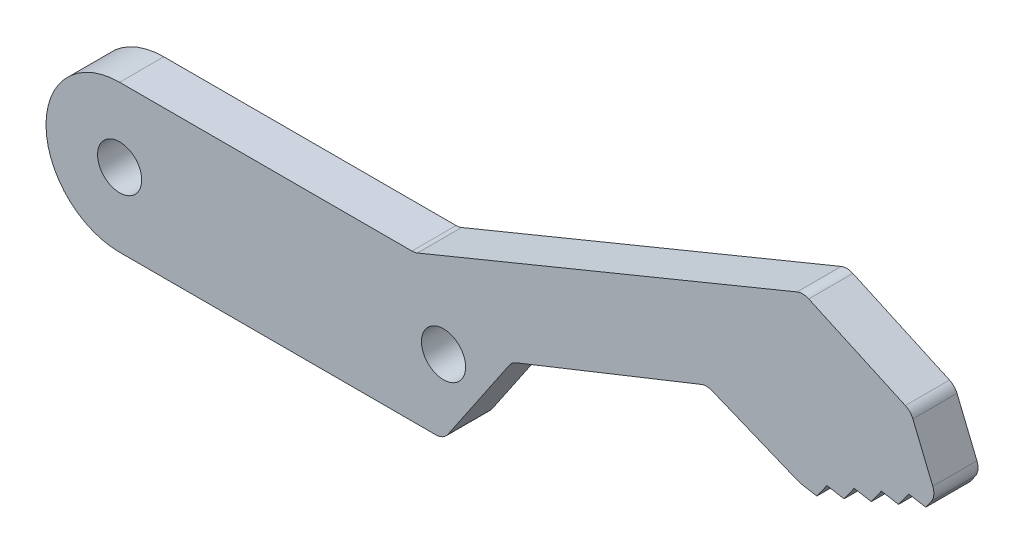
ISO-10303-21;
HEADER;
FILE_DESCRIPTION(('STEP AP214'),'2;1');
FILE_NAME('part.step','',(''),(''),'','','');
FILE_SCHEMA(('AUTOMOTIVE_DESIGN { 1 0 10303 214 1 1 1 1 }'));
ENDSEC;
DATA;
#1=APPLICATION_CONTEXT('core data for automotive mechanical design processes');
#2=APPLICATION_PROTOCOL_DEFINITION('international standard','automotive_design',2000,#1);
#3=PRODUCT_CONTEXT('',#1,'mechanical');
#4=PRODUCT('Part','Part','',(#3));
#5=PRODUCT_RELATED_PRODUCT_CATEGORY('part','',(#4));
#6=PRODUCT_DEFINITION_FORMATION('','',#4);
#7=PRODUCT_DEFINITION_CONTEXT('part definition',#1,'design');
#8=PRODUCT_DEFINITION('design','',#6,#7);
#9=PRODUCT_DEFINITION_SHAPE('','',#8);
#10=(LENGTH_UNIT() NAMED_UNIT(*) SI_UNIT(.MILLI.,.METRE.));
#11=(NAMED_UNIT(*) PLANE_ANGLE_UNIT() SI_UNIT($,.RADIAN.));
#12=(NAMED_UNIT(*) SI_UNIT($,.STERADIAN.) SOLID_ANGLE_UNIT());
#13=UNCERTAINTY_MEASURE_WITH_UNIT(LENGTH_MEASURE(1.E-05),#10,'distance_accuracy_value','');
#14=(GEOMETRIC_REPRESENTATION_CONTEXT(3) GLOBAL_UNCERTAINTY_ASSIGNED_CONTEXT((#13)) GLOBAL_UNIT_ASSIGNED_CONTEXT((#10,
#11,#12)) REPRESENTATION_CONTEXT('',''));
#15=CARTESIAN_POINT('',(0.,0.,0.));
#16=DIRECTION('',(0.,0.,1.));
#17=DIRECTION('',(1.,0.,0.));
#18=AXIS2_PLACEMENT_3D('',#15,#16,#17);
#19=CARTESIAN_POINT('',(17.3962094769043,-11.7918515015879,3.));
#20=DIRECTION('',(0.82775687017251,-0.561086948593719,0.));
#21=DIRECTION('',(0.561086948593719,0.82775687017251,0.));
#22=AXIS2_PLACEMENT_3D('',#19,#20,#21);
#23=PLANE('',#22);
#24=DIRECTION('',(-0.561086948593719,-0.82775687017251,0.));
#25=VECTOR('',#24,1.);
#26=CARTESIAN_POINT('',(17.3962094769043,-11.7918515015879,0.));
#27=LINE('',#26,#25);
#28=CARTESIAN_POINT('',(26.4721926347983,1.59770858592846,0.));
#29=VERTEX_POINT('',#28);
#30=CARTESIAN_POINT('',(22.2975129456313,-4.56108694859372,0.));
#31=VERTEX_POINT('',#30);
#32=EDGE_CURVE('E403',#29,#31,#27,.T.);
#33=ORIENTED_EDGE('',*,*,#32,.F.);
#34=DIRECTION('',(0.,0.,-1.));
#35=VECTOR('',#34,1.);
#36=CARTESIAN_POINT('',(26.4721926347983,1.59770858592845,3.));
#37=LINE('',#36,#35);
#38=CARTESIAN_POINT('',(26.4721926347983,1.59770858592846,3.));
#39=VERTEX_POINT('',#38);
#40=EDGE_CURVE('E271',#29,#39,#37,.F.);
#41=ORIENTED_EDGE('',*,*,#40,.T.);
#42=DIRECTION('',(-0.561086948593719,-0.82775687017251,0.));
#43=VECTOR('',#42,1.);
#44=CARTESIAN_POINT('',(17.3962094769043,-11.7918515015879,3.));
#45=LINE('',#44,#43);
#46=CARTESIAN_POINT('',(22.2975129456313,-4.56108694859372,3.));
#47=VERTEX_POINT('',#46);
#48=EDGE_CURVE('E857',#39,#47,#45,.T.);
#49=ORIENTED_EDGE('',*,*,#48,.T.);
#50=DIRECTION('',(0.,0.,-1.));
#51=VECTOR('',#50,1.);
#52=CARTESIAN_POINT('',(22.2975129456313,-4.56108694859372,0.));
#53=LINE('',#52,#51);
#54=EDGE_CURVE('E267',#47,#31,#53,.T.);
#55=ORIENTED_EDGE('',*,*,#54,.T.);
#56=EDGE_LOOP('',(#33,#41,#49,#55));
#57=FACE_BOUND('',#56,.T.);
#58=ADVANCED_FACE('F43',(#57),#23,.T.);
#59=CARTESIAN_POINT('',(3.01771045687276,-7.56855690668185,3.));
#60=DIRECTION('',(0.370362872235569,-0.928887152925166,0.));
#61=DIRECTION('',(0.928887152925166,0.370362872235569,0.));
#62=AXIS2_PLACEMENT_3D('',#59,#60,#61);
#63=PLANE('',#62);
#64=DIRECTION('',(-0.928887152925166,-0.370362872235569,0.));
#65=VECTOR('',#64,1.);
#66=CARTESIAN_POINT('',(3.01771045687276,-7.56855690668185,3.));
#67=LINE('',#66,#65);
#68=CARTESIAN_POINT('',(39.4964940516571,6.97614534835353,3.));
#69=VERTEX_POINT('',#68);
#70=CARTESIAN_POINT('',(26.9295866327353,1.9655087902599,3.));
#71=VERTEX_POINT('',#70);
#72=EDGE_CURVE('E864',#69,#71,#67,.T.);
#73=ORIENTED_EDGE('',*,*,#72,.T.);
#74=DIRECTION('',(0.,0.,-1.));
#75=VECTOR('',#74,1.);
#76=CARTESIAN_POINT('',(26.9295866327353,1.9655087902599,0.));
#77=LINE('',#76,#75);
#78=CARTESIAN_POINT('',(26.9295866327353,1.9655087902599,0.));
#79=VERTEX_POINT('',#78);
#80=EDGE_CURVE('E258',#71,#79,#77,.T.);
#81=ORIENTED_EDGE('',*,*,#80,.T.);
#82=DIRECTION('',(-0.928887152925166,-0.370362872235569,0.));
#83=VECTOR('',#82,1.);
#84=CARTESIAN_POINT('',(3.01771045687276,-7.56855690668185,0.));
#85=LINE('',#84,#83);
#86=CARTESIAN_POINT('',(39.4964940516571,6.97614534835353,0.));
#87=VERTEX_POINT('',#86);
#88=EDGE_CURVE('E406',#87,#79,#85,.T.);
#89=ORIENTED_EDGE('',*,*,#88,.F.);
#90=DIRECTION('',(0.,0.,-1.));
#91=VECTOR('',#90,1.);
#92=CARTESIAN_POINT('',(39.4964940516571,6.97614534835353,3.));
#93=LINE('',#92,#91);
#94=EDGE_CURVE('E254',#87,#69,#93,.F.);
#95=ORIENTED_EDGE('',*,*,#94,.T.);
#96=EDGE_LOOP('',(#73,#81,#89,#95));
#97=FACE_BOUND('',#96,.T.);
#98=ADVANCED_FACE('F585',(#97),#63,.T.);
#99=CARTESIAN_POINT('',(8.22079154562797,20.0822867610106,3.));
#100=DIRECTION('',(-0.378842481424512,-0.925461168428,0.));
#101=DIRECTION('',(0.925461168428,-0.378842481424512,0.));
#102=AXIS2_PLACEMENT_3D('',#99,#100,#101);
#103=PLANE('',#102);
#104=DIRECTION('',(-0.925461168428,0.378842481424512,0.));
#105=VECTOR('',#104,1.);
#106=CARTESIAN_POINT('',(8.22079154562797,20.0822867610106,3.));
#107=LINE('',#106,#105);
#108=CARTESIAN_POINT('',(46.0879419933528,4.58116609869354,3.));
#109=VERTEX_POINT('',#108);
#110=CARTESIAN_POINT('',(40.2456994053172,6.97271936385637,3.));
#111=VERTEX_POINT('',#110);
#112=EDGE_CURVE('E237',#109,#111,#107,.T.);
#113=ORIENTED_EDGE('',*,*,#112,.T.);
#114=DIRECTION('',(0.,0.,-1.));
#115=VECTOR('',#114,1.);
#116=CARTESIAN_POINT('',(40.2456994053171,6.97271936385637,0.));
#117=LINE('',#116,#115);
#118=CARTESIAN_POINT('',(40.2456994053172,6.97271936385637,0.));
#119=VERTEX_POINT('',#118);
#120=EDGE_CURVE('E308',#111,#119,#117,.T.);
#121=ORIENTED_EDGE('',*,*,#120,.T.);
#122=DIRECTION('',(-0.925461168428,0.378842481424512,0.));
#123=VECTOR('',#122,1.);
#124=CARTESIAN_POINT('',(8.22079154562797,20.0822867610106,0.));
#125=LINE('',#124,#123);
#126=CARTESIAN_POINT('',(46.0879419933528,4.58116609869354,0.));
#127=VERTEX_POINT('',#126);
#128=EDGE_CURVE('E410',#127,#119,#125,.T.);
#129=ORIENTED_EDGE('',*,*,#128,.F.);
#130=DIRECTION('',(0.,0.,-1.));
#131=VECTOR('',#130,1.);
#132=CARTESIAN_POINT('',(46.0879419933528,4.58116609869354,3.));
#133=LINE('',#132,#131);
#134=EDGE_CURVE('E305',#127,#109,#133,.F.);
#135=ORIENTED_EDGE('',*,*,#134,.T.);
#136=EDGE_LOOP('',(#113,#121,#129,#135));
#137=FACE_BOUND('',#136,.T.);
#138=ADVANCED_FACE('F591',(#137),#103,.T.);
#139=CARTESIAN_POINT('',(2.12068725055261,12.2001062019428,3.));
#140=DIRECTION('',(0.171257275030367,0.985226342395073,0.));
#141=DIRECTION('',(-0.985226342395073,0.171257275030367,0.));
#142=AXIS2_PLACEMENT_3D('',#139,#140,#141);
#143=PLANE('',#142);
#144=DIRECTION('',(0.985226342395073,-0.171257275030367,0.));
#145=VECTOR('',#144,1.);
#146=CARTESIAN_POINT('',(2.12068725055261,12.2001062019428,3.));
#147=LINE('',#146,#145);
#148=CARTESIAN_POINT('',(46.2955271997469,4.52140092472648,3.));
#149=VERTEX_POINT('',#148);
#150=CARTESIAN_POINT('',(47.3529322035688,4.33759717145107,3.));
#151=VERTEX_POINT('',#150);
#152=EDGE_CURVE('E222',#149,#151,#147,.T.);
#153=ORIENTED_EDGE('',*,*,#152,.F.);
#154=DIRECTION('',(0.,0.,-1.));
#155=VECTOR('',#154,1.);
#156=CARTESIAN_POINT('',(46.2955271997469,4.52140092472648,0.));
#157=LINE('',#156,#155);
#158=CARTESIAN_POINT('',(46.2955271997469,4.52140092472648,0.));
#159=VERTEX_POINT('',#158);
#160=EDGE_CURVE('E312',#149,#159,#157,.T.);
#161=ORIENTED_EDGE('',*,*,#160,.T.);
#162=DIRECTION('',(0.985226342395073,-0.171257275030367,0.));
#163=VECTOR('',#162,1.);
#164=CARTESIAN_POINT('',(2.12068725055261,12.2001062019428,0.));
#165=LINE('',#164,#163);
#166=CARTESIAN_POINT('',(47.3529322035688,4.33759717145107,0.));
#167=VERTEX_POINT('',#166);
#168=EDGE_CURVE('E251',#159,#167,#165,.T.);
#169=ORIENTED_EDGE('',*,*,#168,.T.);
#170=DIRECTION('',(0.,0.,-1.));
#171=VECTOR('',#170,1.);
#172=CARTESIAN_POINT('',(47.3529322035688,4.33759717145107,3.));
#173=LINE('',#172,#171);
#174=EDGE_CURVE('E243',#151,#167,#173,.T.);
#175=ORIENTED_EDGE('',*,*,#174,.F.);
#176=EDGE_LOOP('',(#153,#161,#169,#175));
#177=FACE_BOUND('',#176,.T.);
#178=ADVANCED_FACE('F249',(#177),#143,.F.);
#179=CARTESIAN_POINT('',(29.3832302084347,-20.911746854221,3.));
#180=DIRECTION('',(-0.814732571298571,0.579836905746106,0.));
#181=DIRECTION('',(-0.579836905746107,-0.814732571298571,0.));
#182=AXIS2_PLACEMENT_3D('',#179,#180,#181);
#183=PLANE('',#182);
#184=DIRECTION('',(0.579836905746107,0.814732571298571,0.));
#185=VECTOR('',#184,1.);
#186=CARTESIAN_POINT('',(29.3832302084347,-20.911746854221,0.));
#187=LINE('',#186,#185);
#188=CARTESIAN_POINT('',(48.0382444817135,5.30053386792921,0.));
#189=VERTEX_POINT('',#188);
#190=EDGE_CURVE('E416',#167,#189,#187,.T.);
#191=ORIENTED_EDGE('',*,*,#190,.T.);
#192=DIRECTION('',(0.,0.,-1.));
#193=VECTOR('',#192,1.);
#194=CARTESIAN_POINT('',(48.0382444817135,5.30053386792921,3.));
#195=LINE('',#194,#193);
#196=CARTESIAN_POINT('',(48.0382444817135,5.30053386792921,3.));
#197=VERTEX_POINT('',#196);
#198=EDGE_CURVE('E245',#197,#189,#195,.T.);
#199=ORIENTED_EDGE('',*,*,#198,.F.);
#200=DIRECTION('',(0.579836905746107,0.814732571298571,0.));
#201=VECTOR('',#200,1.);
#202=CARTESIAN_POINT('',(29.3832302084347,-20.911746854221,3.));
#203=LINE('',#202,#201);
#204=EDGE_CURVE('E227',#151,#197,#203,.T.);
#205=ORIENTED_EDGE('',*,*,#204,.F.);
#206=ORIENTED_EDGE('',*,*,#174,.T.);
#207=EDGE_LOOP('',(#191,#199,#205,#206));
#208=FACE_BOUND('',#207,.T.);
#209=ADVANCED_FACE('F242',(#208),#183,.F.);
#210=CARTESIAN_POINT('',(2.30326040358772,13.2504316830205,3.));
#211=DIRECTION('',(0.171257275030366,0.985226342395073,0.));
#212=DIRECTION('',(-0.985226342395073,0.171257275030366,0.));
#213=AXIS2_PLACEMENT_3D('',#210,#211,#212);
#214=PLANE('',#213);
#215=DIRECTION('',(0.985226342395073,-0.171257275030366,0.));
#216=VECTOR('',#215,1.);
#217=CARTESIAN_POINT('',(2.30326040358772,13.2504316830205,0.));
#218=LINE('',#217,#216);
#219=CARTESIAN_POINT('',(49.2026886599019,5.09812399691749,0.));
#220=VERTEX_POINT('',#219);
#221=EDGE_CURVE('E419',#189,#220,#218,.T.);
#222=ORIENTED_EDGE('',*,*,#221,.T.);
#223=DIRECTION('',(0.,0.,-1.));
#224=VECTOR('',#223,1.);
#225=CARTESIAN_POINT('',(49.2026886599019,5.09812399691749,3.));
#226=LINE('',#225,#224);
#227=CARTESIAN_POINT('',(49.2026886599019,5.09812399691749,3.));
#228=VERTEX_POINT('',#227);
#229=EDGE_CURVE('E260',#228,#220,#226,.T.);
#230=ORIENTED_EDGE('',*,*,#229,.F.);
#231=DIRECTION('',(0.985226342395073,-0.171257275030366,0.));
#232=VECTOR('',#231,1.);
#233=CARTESIAN_POINT('',(2.30326040358772,13.2504316830205,3.));
#234=LINE('',#233,#232);
#235=EDGE_CURVE('E247',#197,#228,#234,.T.);
#236=ORIENTED_EDGE('',*,*,#235,.F.);
#237=ORIENTED_EDGE('',*,*,#198,.T.);
#238=EDGE_LOOP('',(#222,#230,#236,#237));
#239=FACE_BOUND('',#238,.T.);
#240=ADVANCED_FACE('F506',(#239),#214,.F.);
#241=CARTESIAN_POINT('',(30.2517964891723,-21.5298966648462,3.));
#242=DIRECTION('',(-0.81473257129857,0.579836905746108,0.));
#243=DIRECTION('',(-0.579836905746108,-0.81473257129857,0.));
#244=AXIS2_PLACEMENT_3D('',#241,#242,#243);
#245=PLANE('',#244);
#246=DIRECTION('',(0.579836905746108,0.81473257129857,0.));
#247=VECTOR('',#246,1.);
#248=CARTESIAN_POINT('',(30.2517964891723,-21.5298966648462,0.));
#249=LINE('',#248,#247);
#250=CARTESIAN_POINT('',(49.8880009380466,6.06106069339563,0.));
#251=VERTEX_POINT('',#250);
#252=EDGE_CURVE('E423',#220,#251,#249,.T.);
#253=ORIENTED_EDGE('',*,*,#252,.T.);
#254=DIRECTION('',(0.,0.,-1.));
#255=VECTOR('',#254,1.);
#256=CARTESIAN_POINT('',(49.8880009380466,6.06106069339563,3.));
#257=LINE('',#256,#255);
#258=CARTESIAN_POINT('',(49.8880009380466,6.06106069339563,3.));
#259=VERTEX_POINT('',#258);
#260=EDGE_CURVE('E494',#259,#251,#257,.T.);
#261=ORIENTED_EDGE('',*,*,#260,.F.);
#262=DIRECTION('',(0.579836905746108,0.81473257129857,0.));
#263=VECTOR('',#262,1.);
#264=CARTESIAN_POINT('',(30.2517964891723,-21.5298966648462,3.));
#265=LINE('',#264,#263);
#266=EDGE_CURVE('E504',#228,#259,#265,.T.);
#267=ORIENTED_EDGE('',*,*,#266,.F.);
#268=ORIENTED_EDGE('',*,*,#229,.T.);
#269=EDGE_LOOP('',(#253,#261,#267,#268));
#270=FACE_BOUND('',#269,.T.);
#271=ADVANCED_FACE('F501',(#270),#245,.F.);
#272=CARTESIAN_POINT('',(2.48583355662284,14.3007571640983,3.));
#273=DIRECTION('',(0.171257275030366,0.985226342395073,0.));
#274=DIRECTION('',(-0.985226342395073,0.171257275030366,0.));
#275=AXIS2_PLACEMENT_3D('',#272,#273,#274);
#276=PLANE('',#275);
#277=DIRECTION('',(0.985226342395073,-0.171257275030366,0.));
#278=VECTOR('',#277,1.);
#279=CARTESIAN_POINT('',(2.48583355662284,14.3007571640983,0.));
#280=LINE('',#279,#278);
#281=CARTESIAN_POINT('',(51.052445116235,5.85865082238391,0.));
#282=VERTEX_POINT('',#281);
#283=EDGE_CURVE('E427',#251,#282,#280,.T.);
#284=ORIENTED_EDGE('',*,*,#283,.T.);
#285=DIRECTION('',(0.,0.,-1.));
#286=VECTOR('',#285,1.);
#287=CARTESIAN_POINT('',(51.052445116235,5.85865082238391,3.));
#288=LINE('',#287,#286);
#289=CARTESIAN_POINT('',(51.052445116235,5.85865082238391,3.));
#290=VERTEX_POINT('',#289);
#291=EDGE_CURVE('E490',#290,#282,#288,.T.);
#292=ORIENTED_EDGE('',*,*,#291,.F.);
#293=DIRECTION('',(0.985226342395073,-0.171257275030366,0.));
#294=VECTOR('',#293,1.);
#295=CARTESIAN_POINT('',(2.48583355662284,14.3007571640983,3.));
#296=LINE('',#295,#294);
#297=EDGE_CURVE('E511',#259,#290,#296,.T.);
#298=ORIENTED_EDGE('',*,*,#297,.F.);
#299=ORIENTED_EDGE('',*,*,#260,.T.);
#300=EDGE_LOOP('',(#284,#292,#298,#299));
#301=FACE_BOUND('',#300,.T.);
#302=ADVANCED_FACE('F509',(#301),#276,.F.);
#303=CARTESIAN_POINT('',(31.1203627699101,-22.1480464754713,3.));
#304=DIRECTION('',(-0.814732571298571,0.579836905746105,0.));
#305=DIRECTION('',(-0.579836905746105,-0.814732571298572,0.));
#306=AXIS2_PLACEMENT_3D('',#303,#304,#305);
#307=PLANE('',#306);
#308=DIRECTION('',(0.579836905746105,0.814732571298572,0.));
#309=VECTOR('',#308,1.);
#310=CARTESIAN_POINT('',(31.1203627699101,-22.1480464754713,0.));
#311=LINE('',#310,#309);
#312=CARTESIAN_POINT('',(51.7377573943797,6.82158751886204,0.));
#313=VERTEX_POINT('',#312);
#314=EDGE_CURVE('E431',#282,#313,#311,.T.);
#315=ORIENTED_EDGE('',*,*,#314,.T.);
#316=DIRECTION('',(0.,0.,-1.));
#317=VECTOR('',#316,1.);
#318=CARTESIAN_POINT('',(51.7377573943797,6.82158751886204,3.));
#319=LINE('',#318,#317);
#320=CARTESIAN_POINT('',(51.7377573943797,6.82158751886204,3.));
#321=VERTEX_POINT('',#320);
#322=EDGE_CURVE('E486',#321,#313,#319,.T.);
#323=ORIENTED_EDGE('',*,*,#322,.F.);
#324=DIRECTION('',(0.579836905746105,0.814732571298572,0.));
#325=VECTOR('',#324,1.);
#326=CARTESIAN_POINT('',(31.1203627699101,-22.1480464754713,3.));
#327=LINE('',#326,#325);
#328=EDGE_CURVE('E514',#290,#321,#327,.T.);
#329=ORIENTED_EDGE('',*,*,#328,.F.);
#330=ORIENTED_EDGE('',*,*,#291,.T.);
#331=EDGE_LOOP('',(#315,#323,#329,#330));
#332=FACE_BOUND('',#331,.T.);
#333=ADVANCED_FACE('F575',(#332),#307,.F.);
#334=CARTESIAN_POINT('',(2.66840670965796,15.351082645176,3.));
#335=DIRECTION('',(0.171257275030366,0.985226342395073,0.));
#336=DIRECTION('',(-0.985226342395073,0.171257275030366,0.));
#337=AXIS2_PLACEMENT_3D('',#334,#335,#336);
#338=PLANE('',#337);
#339=DIRECTION('',(0.985226342395073,-0.171257275030366,0.));
#340=VECTOR('',#339,1.);
#341=CARTESIAN_POINT('',(2.66840670965796,15.351082645176,0.));
#342=LINE('',#341,#340);
#343=CARTESIAN_POINT('',(52.9022015725681,6.61917764785032,0.));
#344=VERTEX_POINT('',#343);
#345=EDGE_CURVE('E435',#313,#344,#342,.T.);
#346=ORIENTED_EDGE('',*,*,#345,.T.);
#347=DIRECTION('',(0.,0.,-1.));
#348=VECTOR('',#347,1.);
#349=CARTESIAN_POINT('',(52.9022015725681,6.61917764785032,3.));
#350=LINE('',#349,#348);
#351=CARTESIAN_POINT('',(52.9022015725681,6.61917764785032,3.));
#352=VERTEX_POINT('',#351);
#353=EDGE_CURVE('E482',#352,#344,#350,.T.);
#354=ORIENTED_EDGE('',*,*,#353,.F.);
#355=DIRECTION('',(0.985226342395073,-0.171257275030366,0.));
#356=VECTOR('',#355,1.);
#357=CARTESIAN_POINT('',(2.66840670965796,15.351082645176,3.));
#358=LINE('',#357,#356);
#359=EDGE_CURVE('E523',#321,#352,#358,.T.);
#360=ORIENTED_EDGE('',*,*,#359,.F.);
#361=ORIENTED_EDGE('',*,*,#322,.T.);
#362=EDGE_LOOP('',(#346,#354,#360,#361));
#363=FACE_BOUND('',#362,.T.);
#364=ADVANCED_FACE('F572',(#363),#338,.F.);
#365=CARTESIAN_POINT('',(31.988929050648,-22.7661962860964,3.));
#366=DIRECTION('',(-0.814732571298574,0.579836905746103,0.));
#367=DIRECTION('',(-0.579836905746103,-0.814732571298574,0.));
#368=AXIS2_PLACEMENT_3D('',#365,#366,#367);
#369=PLANE('',#368);
#370=DIRECTION('',(0.579836905746103,0.814732571298574,0.));
#371=VECTOR('',#370,1.);
#372=CARTESIAN_POINT('',(31.988929050648,-22.7661962860964,0.));
#373=LINE('',#372,#371);
#374=CARTESIAN_POINT('',(53.5875138507128,7.58211434432846,0.));
#375=VERTEX_POINT('',#374);
#376=EDGE_CURVE('E439',#344,#375,#373,.T.);
#377=ORIENTED_EDGE('',*,*,#376,.T.);
#378=DIRECTION('',(0.,0.,-1.));
#379=VECTOR('',#378,1.);
#380=CARTESIAN_POINT('',(53.5875138507128,7.58211434432846,3.));
#381=LINE('',#380,#379);
#382=CARTESIAN_POINT('',(53.5875138507128,7.58211434432846,3.));
#383=VERTEX_POINT('',#382);
#384=EDGE_CURVE('E478',#383,#375,#381,.T.);
#385=ORIENTED_EDGE('',*,*,#384,.F.);
#386=DIRECTION('',(0.579836905746103,0.814732571298574,0.));
#387=VECTOR('',#386,1.);
#388=CARTESIAN_POINT('',(31.988929050648,-22.7661962860964,3.));
#389=LINE('',#388,#387);
#390=EDGE_CURVE('E527',#352,#383,#389,.T.);
#391=ORIENTED_EDGE('',*,*,#390,.F.);
#392=ORIENTED_EDGE('',*,*,#353,.T.);
#393=EDGE_LOOP('',(#377,#385,#391,#392));
#394=FACE_BOUND('',#393,.T.);
#395=ADVANCED_FACE('F570',(#394),#369,.F.);
#396=CARTESIAN_POINT('',(2.85097986269345,16.4014081262544,3.));
#397=DIRECTION('',(0.171257275030381,0.98522634239507,0.));
#398=DIRECTION('',(-0.985226342395071,0.171257275030381,0.));
#399=AXIS2_PLACEMENT_3D('',#396,#397,#398);
#400=PLANE('',#399);
#401=DIRECTION('',(0.98522634239507,-0.171257275030381,0.));
#402=VECTOR('',#401,1.);
#403=CARTESIAN_POINT('',(2.85097986269345,16.4014081262544,0.));
#404=LINE('',#403,#402);
#405=CARTESIAN_POINT('',(54.7519580289012,7.37970447331672,0.));
#406=VERTEX_POINT('',#405);
#407=EDGE_CURVE('E443',#375,#406,#404,.T.);
#408=ORIENTED_EDGE('',*,*,#407,.T.);
#409=DIRECTION('',(0.,0.,-1.));
#410=VECTOR('',#409,1.);
#411=CARTESIAN_POINT('',(54.7519580289012,7.37970447331672,3.));
#412=LINE('',#411,#410);
#413=CARTESIAN_POINT('',(54.7519580289012,7.37970447331672,3.));
#414=VERTEX_POINT('',#413);
#415=EDGE_CURVE('E474',#414,#406,#412,.T.);
#416=ORIENTED_EDGE('',*,*,#415,.F.);
#417=DIRECTION('',(0.98522634239507,-0.171257275030381,0.));
#418=VECTOR('',#417,1.);
#419=CARTESIAN_POINT('',(2.85097986269345,16.4014081262544,3.));
#420=LINE('',#419,#418);
#421=EDGE_CURVE('E531',#383,#414,#420,.T.);
#422=ORIENTED_EDGE('',*,*,#421,.F.);
#423=ORIENTED_EDGE('',*,*,#384,.T.);
#424=EDGE_LOOP('',(#408,#416,#422,#423));
#425=FACE_BOUND('',#424,.T.);
#426=ADVANCED_FACE('F566',(#425),#400,.F.);
#427=CARTESIAN_POINT('',(32.8574953313856,-23.3843460967215,3.));
#428=DIRECTION('',(-0.814732571298573,0.579836905746103,0.));
#429=DIRECTION('',(-0.579836905746103,-0.814732571298573,0.));
#430=AXIS2_PLACEMENT_3D('',#427,#428,#429);
#431=PLANE('',#430);
#432=DIRECTION('',(0.579836905746103,0.814732571298573,0.));
#433=VECTOR('',#432,1.);
#434=CARTESIAN_POINT('',(32.8574953313856,-23.3843460967215,0.));
#435=LINE('',#434,#433);
#436=CARTESIAN_POINT('',(55.1172552795213,7.89298599323486,0.));
#437=VERTEX_POINT('',#436);
#438=EDGE_CURVE('E447',#406,#437,#435,.T.);
#439=ORIENTED_EDGE('',*,*,#438,.T.);
#440=DIRECTION('',(0.,0.,-1.));
#441=VECTOR('',#440,1.);
#442=CARTESIAN_POINT('',(55.1172552795213,7.89298599323485,3.));
#443=LINE('',#442,#441);
#444=CARTESIAN_POINT('',(55.1172552795213,7.89298599323486,3.));
#445=VERTEX_POINT('',#444);
#446=EDGE_CURVE('E322',#437,#445,#443,.F.);
#447=ORIENTED_EDGE('',*,*,#446,.T.);
#448=DIRECTION('',(0.579836905746103,0.814732571298573,0.));
#449=VECTOR('',#448,1.);
#450=CARTESIAN_POINT('',(32.8574953313856,-23.3843460967215,3.));
#451=LINE('',#450,#449);
#452=EDGE_CURVE('E535',#414,#445,#451,.T.);
#453=ORIENTED_EDGE('',*,*,#452,.F.);
#454=ORIENTED_EDGE('',*,*,#415,.T.);
#455=EDGE_LOOP('',(#439,#447,#453,#454));
#456=FACE_BOUND('',#455,.T.);
#457=ADVANCED_FACE('F563',(#456),#431,.F.);
#458=CARTESIAN_POINT('',(50.3551112402656,20.703489243922,3.));
#459=DIRECTION('',(0.924878228166548,0.380263412733208,0.));
#460=DIRECTION('',(-0.380263412733208,0.924878228166548,0.));
#461=AXIS2_PLACEMENT_3D('',#458,#459,#460);
#462=PLANE('',#461);
#463=DIRECTION('',(0.380263412733209,-0.924878228166548,0.));
#464=VECTOR('',#463,1.);
#465=CARTESIAN_POINT('',(50.3551112402656,20.703489243922,3.));
#466=LINE('',#465,#464);
#467=CARTESIAN_POINT('',(53.8764912996726,12.138774256918,3.));
#468=VERTEX_POINT('',#467);
#469=CARTESIAN_POINT('',(55.2274009363892,8.85308631171416,3.));
#470=VERTEX_POINT('',#469);
#471=EDGE_CURVE('E539',#468,#470,#466,.T.);
#472=ORIENTED_EDGE('',*,*,#471,.T.);
#473=DIRECTION('',(0.,0.,-1.));
#474=VECTOR('',#473,1.);
#475=CARTESIAN_POINT('',(55.2274009363892,8.85308631171416,0.));
#476=LINE('',#475,#474);
#477=CARTESIAN_POINT('',(55.2274009363892,8.85308631171416,0.));
#478=VERTEX_POINT('',#477);
#479=EDGE_CURVE('E318',#470,#478,#476,.T.);
#480=ORIENTED_EDGE('',*,*,#479,.T.);
#481=DIRECTION('',(0.380263412733209,-0.924878228166548,0.));
#482=VECTOR('',#481,1.);
#483=CARTESIAN_POINT('',(50.3551112402656,20.703489243922,0.));
#484=LINE('',#483,#482);
#485=CARTESIAN_POINT('',(53.8764912996726,12.138774256918,0.));
#486=VERTEX_POINT('',#485);
#487=EDGE_CURVE('E451',#486,#478,#484,.T.);
#488=ORIENTED_EDGE('',*,*,#487,.F.);
#489=DIRECTION('',(0.,0.,-1.));
#490=VECTOR('',#489,1.);
#491=CARTESIAN_POINT('',(53.8764912996726,12.138774256918,3.));
#492=LINE('',#491,#490);
#493=EDGE_CURVE('E315',#486,#468,#492,.F.);
#494=ORIENTED_EDGE('',*,*,#493,.T.);
#495=EDGE_LOOP('',(#472,#480,#488,#494));
#496=FACE_BOUND('',#495,.T.);
#497=ADVANCED_FACE('F555',(#496),#462,.T.);
#498=CARTESIAN_POINT('',(13.9488099268583,30.6231164748254,3.));
#499=DIRECTION('',(0.414522259932087,0.910039172794663,0.));
#500=DIRECTION('',(-0.910039172794663,0.414522259932087,0.));
#501=AXIS2_PLACEMENT_3D('',#498,#499,#500);
#502=PLANE('',#501);
#503=DIRECTION('',(0.910039172794663,-0.414522259932087,0.));
#504=VECTOR('',#503,1.);
#505=CARTESIAN_POINT('',(13.9488099268583,30.6231164748254,3.));
#506=LINE('',#505,#504);
#507=CARTESIAN_POINT('',(46.8032086062433,15.6579589338968,3.));
#508=VERTEX_POINT('',#507);
#509=CARTESIAN_POINT('',(53.3661353314382,12.6685500169795,3.));
#510=VERTEX_POINT('',#509);
#511=EDGE_CURVE('E388',#508,#510,#506,.T.);
#512=ORIENTED_EDGE('',*,*,#511,.T.);
#513=DIRECTION('',(0.,0.,-1.));
#514=VECTOR('',#513,1.);
#515=CARTESIAN_POINT('',(53.3661353314382,12.6685500169795,3.));
#516=LINE('',#515,#514);
#517=CARTESIAN_POINT('',(53.3661353314382,12.6685500169795,0.));
#518=VERTEX_POINT('',#517);
#519=EDGE_CURVE('E328',#510,#518,#516,.T.);
#520=ORIENTED_EDGE('',*,*,#519,.T.);
#521=DIRECTION('',(0.910039172794663,-0.414522259932087,0.));
#522=VECTOR('',#521,1.);
#523=CARTESIAN_POINT('',(13.9488099268583,30.6231164748254,0.));
#524=LINE('',#523,#522);
#525=CARTESIAN_POINT('',(46.8032086062433,15.6579589338968,0.));
#526=VERTEX_POINT('',#525);
#527=EDGE_CURVE('E372',#526,#518,#524,.T.);
#528=ORIENTED_EDGE('',*,*,#527,.F.);
#529=DIRECTION('',(0.,0.,-1.));
#530=VECTOR('',#529,1.);
#531=CARTESIAN_POINT('',(46.8032086062433,15.6579589338968,3.));
#532=LINE('',#531,#530);
#533=EDGE_CURVE('E325',#526,#508,#532,.F.);
#534=ORIENTED_EDGE('',*,*,#533,.T.);
#535=EDGE_LOOP('',(#512,#520,#528,#534));
#536=FACE_BOUND('',#535,.T.);
#537=ADVANCED_FACE('F546',(#536),#502,.T.);
#538=CARTESIAN_POINT('',(1.14074851739701,-2.77453321099285,3.));
#539=DIRECTION('',(-0.380263412733207,0.924878228166549,0.));
#540=DIRECTION('',(-0.924878228166549,-0.380263412733207,0.));
#541=AXIS2_PLACEMENT_3D('',#538,#539,#540);
#542=PLANE('',#541);
#543=DIRECTION('',(0.924878228166549,0.380263412733207,0.));
#544=VECTOR('',#543,1.);
#545=CARTESIAN_POINT('',(1.14074851739701,-2.77453321099285,3.));
#546=LINE('',#545,#544);
#547=CARTESIAN_POINT('',(20.2327114807882,5.07512177183346,3.));
#548=VERTEX_POINT('',#547);
#549=CARTESIAN_POINT('',(46.0084229335781,15.6727979892687,3.));
#550=VERTEX_POINT('',#549);
#551=EDGE_CURVE('E382',#548,#550,#546,.T.);
#552=ORIENTED_EDGE('',*,*,#551,.T.);
#553=DIRECTION('',(0.,0.,-1.));
#554=VECTOR('',#553,1.);
#555=CARTESIAN_POINT('',(46.0084229335781,15.6727979892687,3.));
#556=LINE('',#555,#554);
#557=CARTESIAN_POINT('',(46.0084229335781,15.6727979892687,0.));
#558=VERTEX_POINT('',#557);
#559=EDGE_CURVE('E335',#550,#558,#556,.T.);
#560=ORIENTED_EDGE('',*,*,#559,.T.);
#561=DIRECTION('',(0.924878228166549,0.380263412733207,0.));
#562=VECTOR('',#561,1.);
#563=CARTESIAN_POINT('',(1.14074851739701,-2.77453321099285,0.));
#564=LINE('',#563,#562);
#565=CARTESIAN_POINT('',(20.2327114807882,5.07512177183346,0.));
#566=VERTEX_POINT('',#565);
#567=EDGE_CURVE('E361',#566,#558,#564,.T.);
#568=ORIENTED_EDGE('',*,*,#567,.F.);
#569=DIRECTION('',(0.,0.,-1.));
#570=VECTOR('',#569,1.);
#571=CARTESIAN_POINT('',(20.2327114807882,5.07512177183345,3.));
#572=LINE('',#571,#570);
#573=EDGE_CURVE('E332',#566,#548,#572,.F.);
#574=ORIENTED_EDGE('',*,*,#573,.T.);
#575=EDGE_LOOP('',(#552,#560,#568,#574));
#576=FACE_BOUND('',#575,.T.);
#577=ADVANCED_FACE('F369',(#576),#542,.T.);
#578=CARTESIAN_POINT('',(0.,5.,3.));
#579=DIRECTION('',(0.,1.,0.));
#580=DIRECTION('',(0.,0.,1.));
#581=AXIS2_PLACEMENT_3D('',#578,#579,#580);
#582=PLANE('',#581);
#583=DIRECTION('',(1.,0.,0.));
#584=VECTOR('',#583,1.);
#585=CARTESIAN_POINT('',(0.,5.,3.));
#586=LINE('',#585,#584);
#587=CARTESIAN_POINT('',(0.,5.,3.));
#588=VERTEX_POINT('',#587);
#589=CARTESIAN_POINT('',(19.852448068055,5.,3.));
#590=VERTEX_POINT('',#589);
#591=EDGE_CURVE('E376',#588,#590,#586,.T.);
#592=ORIENTED_EDGE('',*,*,#591,.T.);
#593=DIRECTION('',(0.,0.,-1.));
#594=VECTOR('',#593,1.);
#595=CARTESIAN_POINT('',(19.852448068055,5.,0.));
#596=LINE('',#595,#594);
#597=CARTESIAN_POINT('',(19.852448068055,5.,0.));
#598=VERTEX_POINT('',#597);
#599=EDGE_CURVE('E339',#590,#598,#596,.T.);
#600=ORIENTED_EDGE('',*,*,#599,.T.);
#601=DIRECTION('',(1.,0.,0.));
#602=VECTOR('',#601,1.);
#603=CARTESIAN_POINT('',(0.,5.,0.));
#604=LINE('',#603,#602);
#605=CARTESIAN_POINT('',(0.,5.,0.));
#606=VERTEX_POINT('',#605);
#607=EDGE_CURVE('E364',#606,#598,#604,.T.);
#608=ORIENTED_EDGE('',*,*,#607,.F.);
#609=DIRECTION('',(0.,0.,-1.));
#610=VECTOR('',#609,1.);
#611=CARTESIAN_POINT('',(0.,5.,3.));
#612=LINE('',#611,#610);
#613=EDGE_CURVE('E377',#588,#606,#612,.T.);
#614=ORIENTED_EDGE('',*,*,#613,.F.);
#615=EDGE_LOOP('',(#592,#600,#608,#614));
#616=FACE_BOUND('',#615,.T.);
#617=ADVANCED_FACE('F375',(#616),#582,.T.);
#618=CARTESIAN_POINT('',(0.,0.,3.));
#619=DIRECTION('',(0.,0.,-1.));
#620=DIRECTION('',(-1.,0.,0.));
#621=AXIS2_PLACEMENT_3D('',#618,#619,#620);
#622=CYLINDRICAL_SURFACE('',#621,5.);
#623=CARTESIAN_POINT('',(0.,0.,0.));
#624=DIRECTION('',(0.,0.,1.));
#625=DIRECTION('',(1.,0.,0.));
#626=AXIS2_PLACEMENT_3D('',#623,#624,#625);
#627=CIRCLE('',#626,5.);
#628=CARTESIAN_POINT('',(0.,-5.,0.));
#629=VERTEX_POINT('',#628);
#630=EDGE_CURVE('E460',#606,#629,#627,.T.);
#631=ORIENTED_EDGE('',*,*,#630,.T.);
#632=DIRECTION('',(0.,0.,-1.));
#633=VECTOR('',#632,1.);
#634=CARTESIAN_POINT('',(0.,-5.,3.));
#635=LINE('',#634,#633);
#636=CARTESIAN_POINT('',(0.,-5.,3.));
#637=VERTEX_POINT('',#636);
#638=EDGE_CURVE('E394',#637,#629,#635,.T.);
#639=ORIENTED_EDGE('',*,*,#638,.F.);
#640=CARTESIAN_POINT('',(0.,0.,3.));
#641=DIRECTION('',(0.,0.,1.));
#642=DIRECTION('',(1.,0.,0.));
#643=AXIS2_PLACEMENT_3D('',#640,#641,#642);
#644=CIRCLE('',#643,5.);
#645=EDGE_CURVE('E381',#588,#637,#644,.T.);
#646=ORIENTED_EDGE('',*,*,#645,.F.);
#647=ORIENTED_EDGE('',*,*,#613,.T.);
#648=EDGE_LOOP('',(#631,#639,#646,#647));
#649=FACE_BOUND('',#648,.T.);
#650=ADVANCED_FACE('F601',(#649),#622,.T.);
#651=CARTESIAN_POINT('',(0.,0.,3.));
#652=DIRECTION('',(0.,0.,-1.));
#653=DIRECTION('',(-1.,0.,0.));
#654=AXIS2_PLACEMENT_3D('',#651,#652,#653);
#655=CYLINDRICAL_SURFACE('',#654,1.5);
#656=CARTESIAN_POINT('',(0.,0.,3.));
#657=DIRECTION('',(0.,0.,1.));
#658=DIRECTION('',(1.,0.,0.));
#659=AXIS2_PLACEMENT_3D('',#656,#657,#658);
#660=CIRCLE('',#659,1.5);
#661=CARTESIAN_POINT('',(1.5,0.,3.));
#662=VERTEX_POINT('',#661);
#663=EDGE_CURVE('E872',#662,#662,#660,.T.);
#664=ORIENTED_EDGE('',*,*,#663,.T.);
#665=EDGE_LOOP('',(#664));
#666=FACE_BOUND('',#665,.T.);
#667=CARTESIAN_POINT('',(0.,0.,0.));
#668=DIRECTION('',(0.,0.,1.));
#669=DIRECTION('',(1.,0.,0.));
#670=AXIS2_PLACEMENT_3D('',#667,#668,#669);
#671=CIRCLE('',#670,1.5);
#672=CARTESIAN_POINT('',(1.5,0.,0.));
#673=VERTEX_POINT('',#672);
#674=EDGE_CURVE('E399',#673,#673,#671,.T.);
#675=ORIENTED_EDGE('',*,*,#674,.F.);
#676=EDGE_LOOP('',(#675));
#677=FACE_BOUND('',#676,.T.);
#678=ADVANCED_FACE('F597',(#666,#677),#655,.F.);
#679=CARTESIAN_POINT('',(22.,0.,3.));
#680=DIRECTION('',(0.,0.,-1.));
#681=DIRECTION('',(-1.,0.,0.));
#682=AXIS2_PLACEMENT_3D('',#679,#680,#681);
#683=CYLINDRICAL_SURFACE('',#682,1.5);
#684=CARTESIAN_POINT('',(22.,0.,3.));
#685=DIRECTION('',(0.,0.,1.));
#686=DIRECTION('',(1.,0.,0.));
#687=AXIS2_PLACEMENT_3D('',#684,#685,#686);
#688=CIRCLE('',#687,1.5);
#689=CARTESIAN_POINT('',(23.5,0.,3.));
#690=VERTEX_POINT('',#689);
#691=EDGE_CURVE('E468',#690,#690,#688,.T.);
#692=ORIENTED_EDGE('',*,*,#691,.T.);
#693=EDGE_LOOP('',(#692));
#694=FACE_BOUND('',#693,.T.);
#695=CARTESIAN_POINT('',(22.,0.,0.));
#696=DIRECTION('',(0.,0.,1.));
#697=DIRECTION('',(1.,0.,0.));
#698=AXIS2_PLACEMENT_3D('',#695,#696,#697);
#699=CIRCLE('',#698,1.5);
#700=CARTESIAN_POINT('',(23.5,0.,0.));
#701=VERTEX_POINT('',#700);
#702=EDGE_CURVE('E395',#701,#701,#699,.T.);
#703=ORIENTED_EDGE('',*,*,#702,.F.);
#704=EDGE_LOOP('',(#703));
#705=FACE_BOUND('',#704,.T.);
#706=ADVANCED_FACE('F600',(#694,#705),#683,.F.);
#707=CARTESIAN_POINT('',(0.,-5.,3.));
#708=DIRECTION('',(0.,1.,0.));
#709=DIRECTION('',(0.,0.,1.));
#710=AXIS2_PLACEMENT_3D('',#707,#708,#709);
#711=PLANE('',#710);
#712=DIRECTION('',(1.,0.,0.));
#713=VECTOR('',#712,1.);
#714=CARTESIAN_POINT('',(0.,-5.,0.));
#715=LINE('',#714,#713);
#716=CARTESIAN_POINT('',(21.4697560754588,-5.,0.));
#717=VERTEX_POINT('',#716);
#718=EDGE_CURVE('E464',#629,#717,#715,.T.);
#719=ORIENTED_EDGE('',*,*,#718,.T.);
#720=DIRECTION('',(0.,0.,-1.));
#721=VECTOR('',#720,1.);
#722=CARTESIAN_POINT('',(21.4697560754588,-5.,3.));
#723=LINE('',#722,#721);
#724=CARTESIAN_POINT('',(21.4697560754588,-5.,3.));
#725=VERTEX_POINT('',#724);
#726=EDGE_CURVE('E289',#717,#725,#723,.F.);
#727=ORIENTED_EDGE('',*,*,#726,.T.);
#728=DIRECTION('',(1.,0.,0.));
#729=VECTOR('',#728,1.);
#730=CARTESIAN_POINT('',(0.,-5.,3.));
#731=LINE('',#730,#729);
#732=EDGE_CURVE('E386',#637,#725,#731,.T.);
#733=ORIENTED_EDGE('',*,*,#732,.F.);
#734=ORIENTED_EDGE('',*,*,#638,.T.);
#735=EDGE_LOOP('',(#719,#727,#733,#734));
#736=FACE_BOUND('',#735,.T.);
#737=ADVANCED_FACE('F605',(#736),#711,.F.);
#738=CARTESIAN_POINT('',(0.,0.,3.));
#739=DIRECTION('',(0.,0.,1.));
#740=DIRECTION('',(1.,0.,0.));
#741=AXIS2_PLACEMENT_3D('',#738,#739,#740);
#742=PLANE('',#741);
#743=ORIENTED_EDGE('',*,*,#691,.F.);
#744=EDGE_LOOP('',(#743));
#745=FACE_BOUND('',#744,.T.);
#746=ORIENTED_EDGE('',*,*,#663,.F.);
#747=EDGE_LOOP('',(#746));
#748=FACE_BOUND('',#747,.T.);
#749=ORIENTED_EDGE('',*,*,#732,.T.);
#750=CARTESIAN_POINT('',(21.4697560754588,-4.,3.));
#751=DIRECTION('',(0.,0.,1.));
#752=DIRECTION('',(1.,0.,0.));
#753=AXIS2_PLACEMENT_3D('',#750,#751,#752);
#754=CIRCLE('',#753,1.);
#755=EDGE_CURVE('E302',#725,#47,#754,.T.);
#756=ORIENTED_EDGE('',*,*,#755,.T.);
#757=ORIENTED_EDGE('',*,*,#48,.F.);
#758=CARTESIAN_POINT('',(27.2999495049708,1.03662163733474,3.));
#759=DIRECTION('',(0.,0.,1.));
#760=DIRECTION('',(1.,0.,0.));
#761=AXIS2_PLACEMENT_3D('',#758,#759,#760);
#762=CIRCLE('',#761,1.);
#763=EDGE_CURVE('E346',#39,#71,#762,.F.);
#764=ORIENTED_EDGE('',*,*,#763,.T.);
#765=ORIENTED_EDGE('',*,*,#72,.F.);
#766=CARTESIAN_POINT('',(39.8668569238926,6.04725819542837,3.));
#767=DIRECTION('',(0.,0.,1.));
#768=DIRECTION('',(1.,0.,0.));
#769=AXIS2_PLACEMENT_3D('',#766,#767,#768);
#770=CIRCLE('',#769,1.);
#771=EDGE_CURVE('E352',#69,#111,#770,.F.);
#772=ORIENTED_EDGE('',*,*,#771,.T.);
#773=ORIENTED_EDGE('',*,*,#112,.F.);
#774=CARTESIAN_POINT('',(46.4667844747773,5.50662726712155,3.));
#775=DIRECTION('',(0.,0.,1.));
#776=DIRECTION('',(1.,0.,0.));
#777=AXIS2_PLACEMENT_3D('',#774,#775,#776);
#778=CIRCLE('',#777,1.);
#779=EDGE_CURVE('E231',#109,#149,#778,.T.);
#780=ORIENTED_EDGE('',*,*,#779,.T.);
#781=ORIENTED_EDGE('',*,*,#152,.T.);
#782=ORIENTED_EDGE('',*,*,#204,.T.);
#783=ORIENTED_EDGE('',*,*,#235,.T.);
#784=ORIENTED_EDGE('',*,*,#266,.T.);
#785=ORIENTED_EDGE('',*,*,#297,.T.);
#786=ORIENTED_EDGE('',*,*,#328,.T.);
#787=ORIENTED_EDGE('',*,*,#359,.T.);
#788=ORIENTED_EDGE('',*,*,#390,.T.);
#789=ORIENTED_EDGE('',*,*,#421,.T.);
#790=ORIENTED_EDGE('',*,*,#452,.T.);
#791=CARTESIAN_POINT('',(54.3025227082227,8.47282289898095,3.));
#792=DIRECTION('',(0.,0.,1.));
#793=DIRECTION('',(1.,0.,0.));
#794=AXIS2_PLACEMENT_3D('',#791,#792,#793);
#795=CIRCLE('',#794,1.);
#796=EDGE_CURVE('E297',#445,#470,#795,.T.);
#797=ORIENTED_EDGE('',*,*,#796,.T.);
#798=ORIENTED_EDGE('',*,*,#471,.F.);
#799=CARTESIAN_POINT('',(52.9516130715061,11.7585108441848,3.));
#800=DIRECTION('',(0.,0.,1.));
#801=DIRECTION('',(1.,0.,0.));
#802=AXIS2_PLACEMENT_3D('',#799,#800,#801);
#803=CIRCLE('',#802,1.);
#804=EDGE_CURVE('E294',#468,#510,#803,.T.);
#805=ORIENTED_EDGE('',*,*,#804,.T.);
#806=ORIENTED_EDGE('',*,*,#511,.F.);
#807=CARTESIAN_POINT('',(46.3886863463113,14.7479197611021,3.));
#808=DIRECTION('',(0.,0.,1.));
#809=DIRECTION('',(1.,0.,0.));
#810=AXIS2_PLACEMENT_3D('',#807,#808,#809);
#811=CIRCLE('',#810,1.);
#812=EDGE_CURVE('E63',#508,#550,#811,.T.);
#813=ORIENTED_EDGE('',*,*,#812,.T.);
#814=ORIENTED_EDGE('',*,*,#551,.F.);
#815=CARTESIAN_POINT('',(19.852448068055,6.,3.));
#816=DIRECTION('',(0.,0.,1.));
#817=DIRECTION('',(1.,0.,0.));
#818=AXIS2_PLACEMENT_3D('',#815,#816,#817);
#819=CIRCLE('',#818,1.);
#820=EDGE_CURVE('E11',#548,#590,#819,.F.);
#821=ORIENTED_EDGE('',*,*,#820,.T.);
#822=ORIENTED_EDGE('',*,*,#591,.F.);
#823=ORIENTED_EDGE('',*,*,#645,.T.);
#824=EDGE_LOOP('',(#749,#756,#757,#764,#765,#772,#773,#780,#781,#782,#783,#784,#785,#786,#787,
#788,#789,#790,#797,#798,#805,#806,#813,#814,#821,#822,#823));
#825=FACE_BOUND('',#824,.T.);
#826=ADVANCED_FACE('F225',(#745,#748,#825),#742,.T.);
#827=CARTESIAN_POINT('',(0.,0.,0.));
#828=DIRECTION('',(0.,0.,1.));
#829=DIRECTION('',(1.,0.,0.));
#830=AXIS2_PLACEMENT_3D('',#827,#828,#829);
#831=PLANE('',#830);
#832=ORIENTED_EDGE('',*,*,#702,.T.);
#833=EDGE_LOOP('',(#832));
#834=FACE_BOUND('',#833,.T.);
#835=ORIENTED_EDGE('',*,*,#674,.T.);
#836=EDGE_LOOP('',(#835));
#837=FACE_BOUND('',#836,.T.);
#838=ORIENTED_EDGE('',*,*,#32,.T.);
#839=CARTESIAN_POINT('',(21.4697560754588,-4.,0.));
#840=DIRECTION('',(0.,0.,1.));
#841=DIRECTION('',(1.,0.,0.));
#842=AXIS2_PLACEMENT_3D('',#839,#840,#841);
#843=CIRCLE('',#842,1.);
#844=EDGE_CURVE('E286',#31,#717,#843,.F.);
#845=ORIENTED_EDGE('',*,*,#844,.T.);
#846=ORIENTED_EDGE('',*,*,#718,.F.);
#847=ORIENTED_EDGE('',*,*,#630,.F.);
#848=ORIENTED_EDGE('',*,*,#607,.T.);
#849=CARTESIAN_POINT('',(19.852448068055,6.,0.));
#850=DIRECTION('',(0.,0.,1.));
#851=DIRECTION('',(1.,0.,0.));
#852=AXIS2_PLACEMENT_3D('',#849,#850,#851);
#853=CIRCLE('',#852,1.);
#854=EDGE_CURVE('E52',#598,#566,#853,.T.);
#855=ORIENTED_EDGE('',*,*,#854,.T.);
#856=ORIENTED_EDGE('',*,*,#567,.T.);
#857=CARTESIAN_POINT('',(46.3886863463113,14.7479197611021,0.));
#858=DIRECTION('',(0.,0.,1.));
#859=DIRECTION('',(1.,0.,0.));
#860=AXIS2_PLACEMENT_3D('',#857,#858,#859);
#861=CIRCLE('',#860,1.);
#862=EDGE_CURVE('E274',#558,#526,#861,.F.);
#863=ORIENTED_EDGE('',*,*,#862,.T.);
#864=ORIENTED_EDGE('',*,*,#527,.T.);
#865=CARTESIAN_POINT('',(52.9516130715061,11.7585108441848,0.));
#866=DIRECTION('',(0.,0.,1.));
#867=DIRECTION('',(1.,0.,0.));
#868=AXIS2_PLACEMENT_3D('',#865,#866,#867);
#869=CIRCLE('',#868,1.);
#870=EDGE_CURVE('E277',#518,#486,#869,.F.);
#871=ORIENTED_EDGE('',*,*,#870,.T.);
#872=ORIENTED_EDGE('',*,*,#487,.T.);
#873=CARTESIAN_POINT('',(54.3025227082227,8.47282289898095,0.));
#874=DIRECTION('',(0.,0.,1.));
#875=DIRECTION('',(1.,0.,0.));
#876=AXIS2_PLACEMENT_3D('',#873,#874,#875);
#877=CIRCLE('',#876,1.);
#878=EDGE_CURVE('E280',#478,#437,#877,.F.);
#879=ORIENTED_EDGE('',*,*,#878,.T.);
#880=ORIENTED_EDGE('',*,*,#438,.F.);
#881=ORIENTED_EDGE('',*,*,#407,.F.);
#882=ORIENTED_EDGE('',*,*,#376,.F.);
#883=ORIENTED_EDGE('',*,*,#345,.F.);
#884=ORIENTED_EDGE('',*,*,#314,.F.);
#885=ORIENTED_EDGE('',*,*,#283,.F.);
#886=ORIENTED_EDGE('',*,*,#252,.F.);
#887=ORIENTED_EDGE('',*,*,#221,.F.);
#888=ORIENTED_EDGE('',*,*,#190,.F.);
#889=ORIENTED_EDGE('',*,*,#168,.F.);
#890=CARTESIAN_POINT('',(46.4667844747773,5.50662726712155,0.));
#891=DIRECTION('',(0.,0.,1.));
#892=DIRECTION('',(1.,0.,0.));
#893=AXIS2_PLACEMENT_3D('',#890,#891,#892);
#894=CIRCLE('',#893,1.);
#895=EDGE_CURVE('E283',#159,#127,#894,.F.);
#896=ORIENTED_EDGE('',*,*,#895,.T.);
#897=ORIENTED_EDGE('',*,*,#128,.T.);
#898=CARTESIAN_POINT('',(39.8668569238926,6.04725819542837,0.));
#899=DIRECTION('',(0.,0.,1.));
#900=DIRECTION('',(1.,0.,0.));
#901=AXIS2_PLACEMENT_3D('',#898,#899,#900);
#902=CIRCLE('',#901,1.);
#903=EDGE_CURVE('E349',#119,#87,#902,.T.);
#904=ORIENTED_EDGE('',*,*,#903,.T.);
#905=ORIENTED_EDGE('',*,*,#88,.T.);
#906=CARTESIAN_POINT('',(27.2999495049708,1.03662163733474,0.));
#907=DIRECTION('',(0.,0.,1.));
#908=DIRECTION('',(1.,0.,0.));
#909=AXIS2_PLACEMENT_3D('',#906,#907,#908);
#910=CIRCLE('',#909,1.);
#911=EDGE_CURVE('E343',#79,#29,#910,.T.);
#912=ORIENTED_EDGE('',*,*,#911,.T.);
#913=EDGE_LOOP('',(#838,#845,#846,#847,#848,#855,#856,#863,#864,#871,#872,#879,#880,#881,#882,
#883,#884,#885,#886,#887,#888,#889,#896,#897,#904,#905,#912));
#914=FACE_BOUND('',#913,.T.);
#915=ADVANCED_FACE('F360',(#834,#837,#914),#831,.F.);
#916=CARTESIAN_POINT('',(27.2999495049708,1.03662163733474,3.));
#917=DIRECTION('',(0.,0.,1.));
#918=DIRECTION('',(1.,0.,0.));
#919=AXIS2_PLACEMENT_3D('',#916,#917,#918);
#920=CYLINDRICAL_SURFACE('',#919,1.);
#921=ORIENTED_EDGE('',*,*,#763,.F.);
#922=ORIENTED_EDGE('',*,*,#40,.F.);
#923=ORIENTED_EDGE('',*,*,#911,.F.);
#924=ORIENTED_EDGE('',*,*,#80,.F.);
#925=EDGE_LOOP('',(#921,#922,#923,#924));
#926=FACE_BOUND('',#925,.T.);
#927=ADVANCED_FACE('F607',(#926),#920,.F.);
#928=CARTESIAN_POINT('',(21.4697560754588,-4.,3.));
#929=DIRECTION('',(0.,0.,1.));
#930=DIRECTION('',(1.,0.,0.));
#931=AXIS2_PLACEMENT_3D('',#928,#929,#930);
#932=CYLINDRICAL_SURFACE('',#931,1.);
#933=ORIENTED_EDGE('',*,*,#755,.F.);
#934=ORIENTED_EDGE('',*,*,#726,.F.);
#935=ORIENTED_EDGE('',*,*,#844,.F.);
#936=ORIENTED_EDGE('',*,*,#54,.F.);
#937=EDGE_LOOP('',(#933,#934,#935,#936));
#938=FACE_BOUND('',#937,.T.);
#939=ADVANCED_FACE('F610',(#938),#932,.T.);
#940=CARTESIAN_POINT('',(39.8668569238926,6.04725819542837,3.));
#941=DIRECTION('',(0.,0.,1.));
#942=DIRECTION('',(1.,0.,0.));
#943=AXIS2_PLACEMENT_3D('',#940,#941,#942);
#944=CYLINDRICAL_SURFACE('',#943,1.);
#945=ORIENTED_EDGE('',*,*,#771,.F.);
#946=ORIENTED_EDGE('',*,*,#94,.F.);
#947=ORIENTED_EDGE('',*,*,#903,.F.);
#948=ORIENTED_EDGE('',*,*,#120,.F.);
#949=EDGE_LOOP('',(#945,#946,#947,#948));
#950=FACE_BOUND('',#949,.T.);
#951=ADVANCED_FACE('F614',(#950),#944,.F.);
#952=CARTESIAN_POINT('',(46.4667844747773,5.50662726712155,3.));
#953=DIRECTION('',(0.,0.,1.));
#954=DIRECTION('',(1.,0.,0.));
#955=AXIS2_PLACEMENT_3D('',#952,#953,#954);
#956=CYLINDRICAL_SURFACE('',#955,1.);
#957=ORIENTED_EDGE('',*,*,#779,.F.);
#958=ORIENTED_EDGE('',*,*,#134,.F.);
#959=ORIENTED_EDGE('',*,*,#895,.F.);
#960=ORIENTED_EDGE('',*,*,#160,.F.);
#961=EDGE_LOOP('',(#957,#958,#959,#960));
#962=FACE_BOUND('',#961,.T.);
#963=ADVANCED_FACE('F618',(#962),#956,.T.);
#964=CARTESIAN_POINT('',(54.3025227082227,8.47282289898095,3.));
#965=DIRECTION('',(0.,0.,1.));
#966=DIRECTION('',(1.,0.,0.));
#967=AXIS2_PLACEMENT_3D('',#964,#965,#966);
#968=CYLINDRICAL_SURFACE('',#967,1.);
#969=ORIENTED_EDGE('',*,*,#796,.F.);
#970=ORIENTED_EDGE('',*,*,#446,.F.);
#971=ORIENTED_EDGE('',*,*,#878,.F.);
#972=ORIENTED_EDGE('',*,*,#479,.F.);
#973=EDGE_LOOP('',(#969,#970,#971,#972));
#974=FACE_BOUND('',#973,.T.);
#975=ADVANCED_FACE('F560',(#974),#968,.T.);
#976=CARTESIAN_POINT('',(52.9516130715061,11.7585108441848,3.));
#977=DIRECTION('',(0.,0.,-1.));
#978=DIRECTION('',(-1.,0.,0.));
#979=AXIS2_PLACEMENT_3D('',#976,#977,#978);
#980=CYLINDRICAL_SURFACE('',#979,1.);
#981=ORIENTED_EDGE('',*,*,#804,.F.);
#982=ORIENTED_EDGE('',*,*,#493,.F.);
#983=ORIENTED_EDGE('',*,*,#870,.F.);
#984=ORIENTED_EDGE('',*,*,#519,.F.);
#985=EDGE_LOOP('',(#981,#982,#983,#984));
#986=FACE_BOUND('',#985,.T.);
#987=ADVANCED_FACE('F551',(#986),#980,.T.);
#988=CARTESIAN_POINT('',(46.3886863463113,14.7479197611021,3.));
#989=DIRECTION('',(0.,0.,-1.));
#990=DIRECTION('',(-1.,0.,0.));
#991=AXIS2_PLACEMENT_3D('',#988,#989,#990);
#992=CYLINDRICAL_SURFACE('',#991,1.);
#993=ORIENTED_EDGE('',*,*,#812,.F.);
#994=ORIENTED_EDGE('',*,*,#533,.F.);
#995=ORIENTED_EDGE('',*,*,#862,.F.);
#996=ORIENTED_EDGE('',*,*,#559,.F.);
#997=EDGE_LOOP('',(#993,#994,#995,#996));
#998=FACE_BOUND('',#997,.T.);
#999=ADVANCED_FACE('F626',(#998),#992,.T.);
#1000=CARTESIAN_POINT('',(19.852448068055,6.,3.));
#1001=DIRECTION('',(0.,0.,1.));
#1002=DIRECTION('',(1.,0.,0.));
#1003=AXIS2_PLACEMENT_3D('',#1000,#1001,#1002);
#1004=CYLINDRICAL_SURFACE('',#1003,1.);
#1005=ORIENTED_EDGE('',*,*,#820,.F.);
#1006=ORIENTED_EDGE('',*,*,#573,.F.);
#1007=ORIENTED_EDGE('',*,*,#854,.F.);
#1008=ORIENTED_EDGE('',*,*,#599,.F.);
#1009=EDGE_LOOP('',(#1005,#1006,#1007,#1008));
#1010=FACE_BOUND('',#1009,.T.);
#1011=ADVANCED_FACE('F45',(#1010),#1004,.F.);
#1012=CLOSED_SHELL('',(#58,#98,#138,#178,#209,#240,#271,#302,#333,#364,#395,#426,#457,#497,#537,
#577,#617,#650,#678,#706,#737,#826,#915,#927,#939,#951,#963,#975,#987,#999,#1011));
#1013=MANIFOLD_SOLID_BREP('B2',#1012);
#1014=ADVANCED_BREP_SHAPE_REPRESENTATION('',(#18,#1013),#14);
#1015=SHAPE_DEFINITION_REPRESENTATION(#9,#1014);
ENDSEC;
END-ISO-10303-21;
